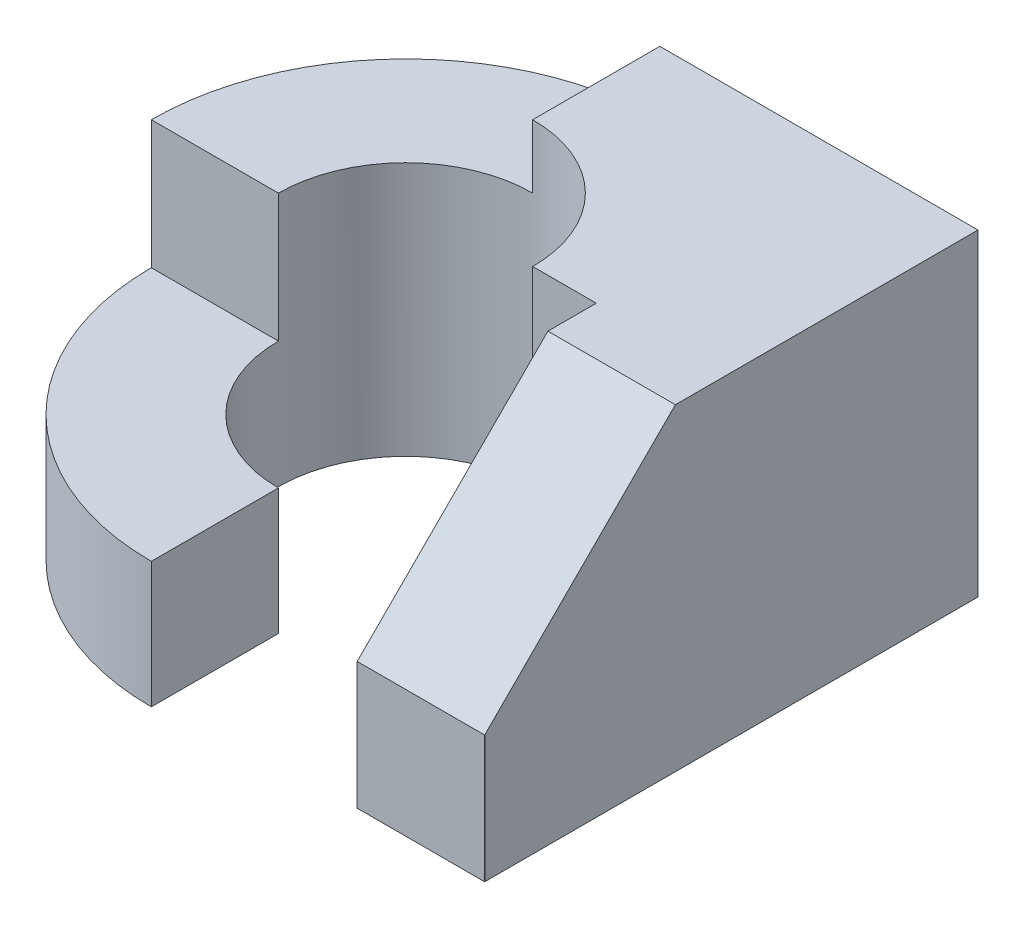
ISO-10303-21;
HEADER;
FILE_DESCRIPTION(('STEP AP214'),'2;1');
FILE_NAME('part.step','',(''),(''),'','','');
FILE_SCHEMA(('AUTOMOTIVE_DESIGN { 1 0 10303 214 1 1 1 1 }'));
ENDSEC;
DATA;
#1=APPLICATION_CONTEXT('core data for automotive mechanical design processes');
#2=APPLICATION_PROTOCOL_DEFINITION('international standard','automotive_design',2000,#1);
#3=PRODUCT_CONTEXT('',#1,'mechanical');
#4=PRODUCT('Part','Part','',(#3));
#5=PRODUCT_RELATED_PRODUCT_CATEGORY('part','',(#4));
#6=PRODUCT_DEFINITION_FORMATION('','',#4);
#7=PRODUCT_DEFINITION_CONTEXT('part definition',#1,'design');
#8=PRODUCT_DEFINITION('design','',#6,#7);
#9=PRODUCT_DEFINITION_SHAPE('','',#8);
#10=(LENGTH_UNIT() NAMED_UNIT(*) SI_UNIT(.MILLI.,.METRE.));
#11=(NAMED_UNIT(*) PLANE_ANGLE_UNIT() SI_UNIT($,.RADIAN.));
#12=(NAMED_UNIT(*) SI_UNIT($,.STERADIAN.) SOLID_ANGLE_UNIT());
#13=UNCERTAINTY_MEASURE_WITH_UNIT(LENGTH_MEASURE(1.E-05),#10,'distance_accuracy_value','');
#14=(GEOMETRIC_REPRESENTATION_CONTEXT(3) GLOBAL_UNCERTAINTY_ASSIGNED_CONTEXT((#13)) GLOBAL_UNIT_ASSIGNED_CONTEXT((#10,
#11,#12)) REPRESENTATION_CONTEXT('',''));
#15=CARTESIAN_POINT('',(0.,0.,0.));
#16=DIRECTION('',(0.,0.,1.));
#17=DIRECTION('',(1.,0.,0.));
#18=AXIS2_PLACEMENT_3D('',#15,#16,#17);
#19=CARTESIAN_POINT('',(0.,5.,0.));
#20=DIRECTION('',(0.,-1.,0.));
#21=DIRECTION('',(0.,0.,-1.));
#22=AXIS2_PLACEMENT_3D('',#19,#20,#21);
#23=CYLINDRICAL_SURFACE('',#22,4.);
#24=DIRECTION('',(0.,-1.,0.));
#25=VECTOR('',#24,1.);
#26=CARTESIAN_POINT('',(-4.,5.,0.));
#27=LINE('',#26,#25);
#28=CARTESIAN_POINT('',(-4.,1.98353352652632,0.));
#29=VERTEX_POINT('',#28);
#30=CARTESIAN_POINT('',(-4.,4.,0.));
#31=VERTEX_POINT('',#30);
#32=EDGE_CURVE('E253',#29,#31,#27,.F.);
#33=ORIENTED_EDGE('',*,*,#32,.T.);
#34=CARTESIAN_POINT('',(0.,4.,0.));
#35=DIRECTION('',(0.,-1.,0.));
#36=DIRECTION('',(0.,0.,-1.));
#37=AXIS2_PLACEMENT_3D('',#34,#35,#36);
#38=CIRCLE('',#37,4.);
#39=CARTESIAN_POINT('',(0.,4.,-4.));
#40=VERTEX_POINT('',#39);
#41=EDGE_CURVE('E256',#31,#40,#38,.T.);
#42=ORIENTED_EDGE('',*,*,#41,.T.);
#43=DIRECTION('',(0.,-1.,0.));
#44=VECTOR('',#43,1.);
#45=CARTESIAN_POINT('',(0.,5.,-4.));
#46=LINE('',#45,#44);
#47=CARTESIAN_POINT('',(0.,0.,-4.));
#48=VERTEX_POINT('',#47);
#49=EDGE_CURVE('E243',#40,#48,#46,.T.);
#50=ORIENTED_EDGE('',*,*,#49,.T.);
#51=CARTESIAN_POINT('',(0.,0.,0.));
#52=DIRECTION('',(0.,1.,0.));
#53=DIRECTION('',(0.,0.,1.));
#54=AXIS2_PLACEMENT_3D('',#51,#52,#53);
#55=CIRCLE('',#54,4.);
#56=CARTESIAN_POINT('',(0.,0.,4.));
#57=VERTEX_POINT('',#56);
#58=EDGE_CURVE('E212',#48,#57,#55,.T.);
#59=ORIENTED_EDGE('',*,*,#58,.T.);
#60=DIRECTION('',(0.,-1.,0.));
#61=VECTOR('',#60,1.);
#62=CARTESIAN_POINT('',(0.,5.,4.));
#63=LINE('',#62,#61);
#64=CARTESIAN_POINT('',(0.,1.98353352652632,4.));
#65=VERTEX_POINT('',#64);
#66=EDGE_CURVE('E211',#65,#57,#63,.T.);
#67=ORIENTED_EDGE('',*,*,#66,.F.);
#68=CARTESIAN_POINT('',(0.,1.98353352652632,0.));
#69=DIRECTION('',(0.,-1.,0.));
#70=DIRECTION('',(0.,0.,-1.));
#71=AXIS2_PLACEMENT_3D('',#68,#69,#70);
#72=CIRCLE('',#71,4.);
#73=EDGE_CURVE('E209',#65,#29,#72,.T.);
#74=ORIENTED_EDGE('',*,*,#73,.T.);
#75=EDGE_LOOP('',(#33,#42,#50,#59,#67,#74));
#76=FACE_BOUND('',#75,.T.);
#77=ADVANCED_FACE('F35',(#76),#23,.T.);
#78=CARTESIAN_POINT('',(0.,5.,0.));
#79=DIRECTION('',(1.,0.,0.));
#80=DIRECTION('',(0.,0.,-1.));
#81=AXIS2_PLACEMENT_3D('',#78,#79,#80);
#82=PLANE('',#81);
#83=DIRECTION('',(0.,0.,-1.));
#84=VECTOR('',#83,1.);
#85=CARTESIAN_POINT('',(0.,1.98353352652632,0.));
#86=LINE('',#85,#84);
#87=CARTESIAN_POINT('',(0.,1.98353352652632,2.));
#88=VERTEX_POINT('',#87);
#89=EDGE_CURVE('E205',#65,#88,#86,.T.);
#90=ORIENTED_EDGE('',*,*,#89,.F.);
#91=ORIENTED_EDGE('',*,*,#66,.T.);
#92=DIRECTION('',(0.,0.,1.));
#93=VECTOR('',#92,1.);
#94=CARTESIAN_POINT('',(0.,0.,0.));
#95=LINE('',#94,#93);
#96=CARTESIAN_POINT('',(0.,0.,2.));
#97=VERTEX_POINT('',#96);
#98=EDGE_CURVE('E228',#97,#57,#95,.T.);
#99=ORIENTED_EDGE('',*,*,#98,.F.);
#100=DIRECTION('',(0.,-1.,0.));
#101=VECTOR('',#100,1.);
#102=CARTESIAN_POINT('',(0.,5.,2.));
#103=LINE('',#102,#101);
#104=EDGE_CURVE('E159',#88,#97,#103,.T.);
#105=ORIENTED_EDGE('',*,*,#104,.F.);
#106=EDGE_LOOP('',(#90,#91,#99,#105));
#107=FACE_BOUND('',#106,.T.);
#108=ADVANCED_FACE('F268',(#107),#82,.T.);
#109=CARTESIAN_POINT('',(0.,5.,0.));
#110=DIRECTION('',(0.,1.,0.));
#111=DIRECTION('',(0.,0.,1.));
#112=AXIS2_PLACEMENT_3D('',#109,#110,#111);
#113=PLANE('',#112);
#114=DIRECTION('',(0.,0.,1.));
#115=VECTOR('',#114,1.);
#116=CARTESIAN_POINT('',(3.,5.,0.));
#117=LINE('',#116,#115);
#118=CARTESIAN_POINT('',(3.,5.,0.));
#119=VERTEX_POINT('',#118);
#120=CARTESIAN_POINT('',(3.,5.,0.760972676788419));
#121=VERTEX_POINT('',#120);
#122=EDGE_CURVE('E191',#119,#121,#117,.T.);
#123=ORIENTED_EDGE('',*,*,#122,.T.);
#124=DIRECTION('',(1.,0.,0.));
#125=VECTOR('',#124,1.);
#126=CARTESIAN_POINT('',(4.99865006533927,5.,0.760972676788419));
#127=LINE('',#126,#125);
#128=CARTESIAN_POINT('',(5.00521632146891,5.,0.760972676788419));
#129=VERTEX_POINT('',#128);
#130=EDGE_CURVE('E165',#121,#129,#127,.T.);
#131=ORIENTED_EDGE('',*,*,#130,.T.);
#132=DIRECTION('',(0.,0.,-1.));
#133=VECTOR('',#132,1.);
#134=CARTESIAN_POINT('',(5.00521632146891,5.,0.));
#135=LINE('',#134,#133);
#136=CARTESIAN_POINT('',(5.00521632146891,5.,-4.));
#137=VERTEX_POINT('',#136);
#138=EDGE_CURVE('E161',#129,#137,#135,.T.);
#139=ORIENTED_EDGE('',*,*,#138,.T.);
#140=DIRECTION('',(-1.,0.,0.));
#141=VECTOR('',#140,1.);
#142=CARTESIAN_POINT('',(0.,5.,-4.));
#143=LINE('',#142,#141);
#144=CARTESIAN_POINT('',(0.,5.,-4.));
#145=VERTEX_POINT('',#144);
#146=EDGE_CURVE('E150',#137,#145,#143,.T.);
#147=ORIENTED_EDGE('',*,*,#146,.T.);
#148=DIRECTION('',(0.,0.,1.));
#149=VECTOR('',#148,1.);
#150=CARTESIAN_POINT('',(0.,5.,-4.));
#151=LINE('',#150,#149);
#152=CARTESIAN_POINT('',(0.,5.,-2.));
#153=VERTEX_POINT('',#152);
#154=EDGE_CURVE('E136',#145,#153,#151,.T.);
#155=ORIENTED_EDGE('',*,*,#154,.T.);
#156=CARTESIAN_POINT('',(0.,5.,0.));
#157=DIRECTION('',(0.,1.,0.));
#158=DIRECTION('',(0.,0.,1.));
#159=AXIS2_PLACEMENT_3D('',#156,#157,#158);
#160=CIRCLE('',#159,2.);
#161=CARTESIAN_POINT('',(2.,5.,0.));
#162=VERTEX_POINT('',#161);
#163=EDGE_CURVE('E143',#162,#153,#160,.T.);
#164=ORIENTED_EDGE('',*,*,#163,.F.);
#165=DIRECTION('',(1.,0.,0.));
#166=VECTOR('',#165,1.);
#167=CARTESIAN_POINT('',(0.,5.,0.));
#168=LINE('',#167,#166);
#169=EDGE_CURVE('E152',#162,#119,#168,.T.);
#170=ORIENTED_EDGE('',*,*,#169,.T.);
#171=EDGE_LOOP('',(#123,#131,#139,#147,#155,#164,#170));
#172=FACE_BOUND('',#171,.T.);
#173=ADVANCED_FACE('F148',(#172),#113,.T.);
#174=CARTESIAN_POINT('',(0.,5.,0.));
#175=DIRECTION('',(0.,-1.,0.));
#176=DIRECTION('',(0.,0.,-1.));
#177=AXIS2_PLACEMENT_3D('',#174,#175,#176);
#178=CYLINDRICAL_SURFACE('',#177,2.);
#179=CARTESIAN_POINT('',(0.,1.98353352652632,0.));
#180=DIRECTION('',(0.,-1.,0.));
#181=DIRECTION('',(0.,0.,-1.));
#182=AXIS2_PLACEMENT_3D('',#179,#180,#181);
#183=CIRCLE('',#182,2.);
#184=CARTESIAN_POINT('',(-2.,1.98353352652632,0.));
#185=VERTEX_POINT('',#184);
#186=EDGE_CURVE('E206',#88,#185,#183,.T.);
#187=ORIENTED_EDGE('',*,*,#186,.F.);
#188=ORIENTED_EDGE('',*,*,#104,.T.);
#189=CARTESIAN_POINT('',(0.,0.,0.));
#190=DIRECTION('',(0.,1.,0.));
#191=DIRECTION('',(0.,0.,1.));
#192=AXIS2_PLACEMENT_3D('',#189,#190,#191);
#193=CIRCLE('',#192,2.);
#194=CARTESIAN_POINT('',(2.,0.,0.));
#195=VERTEX_POINT('',#194);
#196=EDGE_CURVE('E225',#195,#97,#193,.T.);
#197=ORIENTED_EDGE('',*,*,#196,.F.);
#198=DIRECTION('',(0.,-1.,0.));
#199=VECTOR('',#198,1.);
#200=CARTESIAN_POINT('',(2.,5.,0.));
#201=LINE('',#200,#199);
#202=EDGE_CURVE('E157',#162,#195,#201,.T.);
#203=ORIENTED_EDGE('',*,*,#202,.F.);
#204=ORIENTED_EDGE('',*,*,#163,.T.);
#205=DIRECTION('',(0.,-1.,0.));
#206=VECTOR('',#205,1.);
#207=CARTESIAN_POINT('',(0.,5.,-2.));
#208=LINE('',#207,#206);
#209=CARTESIAN_POINT('',(0.,4.,-2.));
#210=VERTEX_POINT('',#209);
#211=EDGE_CURVE('E132',#153,#210,#208,.T.);
#212=ORIENTED_EDGE('',*,*,#211,.T.);
#213=CARTESIAN_POINT('',(0.,4.,0.));
#214=DIRECTION('',(0.,-1.,0.));
#215=DIRECTION('',(0.,0.,-1.));
#216=AXIS2_PLACEMENT_3D('',#213,#214,#215);
#217=CIRCLE('',#216,2.);
#218=CARTESIAN_POINT('',(-2.,4.,0.));
#219=VERTEX_POINT('',#218);
#220=EDGE_CURVE('E200',#219,#210,#217,.T.);
#221=ORIENTED_EDGE('',*,*,#220,.F.);
#222=DIRECTION('',(0.,-1.,0.));
#223=VECTOR('',#222,1.);
#224=CARTESIAN_POINT('',(-2.,5.,0.));
#225=LINE('',#224,#223);
#226=EDGE_CURVE('E203',#185,#219,#225,.F.);
#227=ORIENTED_EDGE('',*,*,#226,.F.);
#228=EDGE_LOOP('',(#187,#188,#197,#203,#204,#212,#221,#227));
#229=FACE_BOUND('',#228,.T.);
#230=ADVANCED_FACE('F155',(#229),#178,.F.);
#231=CARTESIAN_POINT('',(0.,5.,0.));
#232=DIRECTION('',(0.,0.,-1.));
#233=DIRECTION('',(-1.,0.,0.));
#234=AXIS2_PLACEMENT_3D('',#231,#232,#233);
#235=PLANE('',#234);
#236=DIRECTION('',(1.,0.,0.));
#237=VECTOR('',#236,1.);
#238=CARTESIAN_POINT('',(0.,0.,0.));
#239=LINE('',#238,#237);
#240=CARTESIAN_POINT('',(3.,0.,0.));
#241=VERTEX_POINT('',#240);
#242=EDGE_CURVE('E142',#195,#241,#239,.T.);
#243=ORIENTED_EDGE('',*,*,#242,.T.);
#244=DIRECTION('',(0.,-1.,0.));
#245=VECTOR('',#244,1.);
#246=CARTESIAN_POINT('',(3.,5.,0.));
#247=LINE('',#246,#245);
#248=EDGE_CURVE('E233',#119,#241,#247,.T.);
#249=ORIENTED_EDGE('',*,*,#248,.F.);
#250=ORIENTED_EDGE('',*,*,#169,.F.);
#251=ORIENTED_EDGE('',*,*,#202,.T.);
#252=EDGE_LOOP('',(#243,#249,#250,#251));
#253=FACE_BOUND('',#252,.T.);
#254=ADVANCED_FACE('F294',(#253),#235,.F.);
#255=CARTESIAN_POINT('',(3.,5.,0.));
#256=DIRECTION('',(1.,0.,0.));
#257=DIRECTION('',(0.,0.,-1.));
#258=AXIS2_PLACEMENT_3D('',#255,#256,#257);
#259=PLANE('',#258);
#260=DIRECTION('',(0.,-1.,0.));
#261=VECTOR('',#260,1.);
#262=CARTESIAN_POINT('',(3.,5.,3.76097267678843));
#263=LINE('',#262,#261);
#264=CARTESIAN_POINT('',(3.,1.99999999999999,3.76097267678843));
#265=VERTEX_POINT('',#264);
#266=CARTESIAN_POINT('',(3.,0.,3.76097267678843));
#267=VERTEX_POINT('',#266);
#268=EDGE_CURVE('E193',#265,#267,#263,.T.);
#269=ORIENTED_EDGE('',*,*,#268,.F.);
#270=DIRECTION('',(0.,0.707106781186548,-0.707106781186548));
#271=VECTOR('',#270,1.);
#272=CARTESIAN_POINT('',(3.,5.,0.760972676788418));
#273=LINE('',#272,#271);
#274=EDGE_CURVE('E11',#265,#121,#273,.T.);
#275=ORIENTED_EDGE('',*,*,#274,.T.);
#276=ORIENTED_EDGE('',*,*,#122,.F.);
#277=ORIENTED_EDGE('',*,*,#248,.T.);
#278=DIRECTION('',(0.,0.,1.));
#279=VECTOR('',#278,1.);
#280=CARTESIAN_POINT('',(3.,0.,0.));
#281=LINE('',#280,#279);
#282=EDGE_CURVE('E231',#241,#267,#281,.T.);
#283=ORIENTED_EDGE('',*,*,#282,.T.);
#284=EDGE_LOOP('',(#269,#275,#276,#277,#283));
#285=FACE_BOUND('',#284,.T.);
#286=ADVANCED_FACE('F189',(#285),#259,.F.);
#287=CARTESIAN_POINT('',(0.,5.,3.76097267678843));
#288=DIRECTION('',(0.,0.,-1.));
#289=DIRECTION('',(-1.,0.,0.));
#290=AXIS2_PLACEMENT_3D('',#287,#288,#289);
#291=PLANE('',#290);
#292=DIRECTION('',(0.,-1.,0.));
#293=VECTOR('',#292,1.);
#294=CARTESIAN_POINT('',(4.99865006533927,5.,3.76097267678843));
#295=LINE('',#294,#293);
#296=CARTESIAN_POINT('',(4.99865006533927,1.99999999999999,3.76097267678843));
#297=VERTEX_POINT('',#296);
#298=CARTESIAN_POINT('',(4.99865006533927,0.,3.76097267678843));
#299=VERTEX_POINT('',#298);
#300=EDGE_CURVE('E238',#297,#299,#295,.T.);
#301=ORIENTED_EDGE('',*,*,#300,.F.);
#302=DIRECTION('',(-1.,0.,0.));
#303=VECTOR('',#302,1.);
#304=CARTESIAN_POINT('',(3.,1.99999999999999,3.76097267678843));
#305=LINE('',#304,#303);
#306=EDGE_CURVE('E43',#297,#265,#305,.T.);
#307=ORIENTED_EDGE('',*,*,#306,.T.);
#308=ORIENTED_EDGE('',*,*,#268,.T.);
#309=DIRECTION('',(1.,0.,0.));
#310=VECTOR('',#309,1.);
#311=CARTESIAN_POINT('',(0.,0.,3.76097267678843));
#312=LINE('',#311,#310);
#313=EDGE_CURVE('E234',#267,#299,#312,.T.);
#314=ORIENTED_EDGE('',*,*,#313,.T.);
#315=EDGE_LOOP('',(#301,#307,#308,#314));
#316=FACE_BOUND('',#315,.T.);
#317=ADVANCED_FACE('F319',(#316),#291,.F.);
#318=CARTESIAN_POINT('',(2.68170270810586,5.,5.00292014414876));
#319=DIRECTION('',(-0.472435886548881,0.,-0.881365039640655));
#320=DIRECTION('',(-0.881365039640655,0.,0.472435886548881));
#321=AXIS2_PLACEMENT_3D('',#318,#319,#320);
#322=PLANE('',#321);
#323=DIRECTION('',(0.,-1.,0.));
#324=VECTOR('',#323,1.);
#325=CARTESIAN_POINT('',(5.00521632146891,5.,3.75745298302206));
#326=LINE('',#325,#324);
#327=CARTESIAN_POINT('',(5.00521632146891,2.00351969376635,3.75745298302206));
#328=VERTEX_POINT('',#327);
#329=CARTESIAN_POINT('',(5.00521632146891,0.,3.75745298302206));
#330=VERTEX_POINT('',#329);
#331=EDGE_CURVE('E174',#328,#330,#326,.T.);
#332=ORIENTED_EDGE('',*,*,#331,.F.);
#333=DIRECTION('',(-0.796907387330017,-0.427164263497572,0.427164263497572));
#334=VECTOR('',#333,1.);
#335=CARTESIAN_POINT('',(3.86666257991505,1.39322359387356,4.36774908291486));
#336=LINE('',#335,#334);
#337=EDGE_CURVE('E57',#328,#297,#336,.T.);
#338=ORIENTED_EDGE('',*,*,#337,.T.);
#339=ORIENTED_EDGE('',*,*,#300,.T.);
#340=DIRECTION('',(0.881365039640655,0.,-0.472435886548881));
#341=VECTOR('',#340,1.);
#342=CARTESIAN_POINT('',(2.68170270810586,0.,5.00292014414876));
#343=LINE('',#342,#341);
#344=EDGE_CURVE('E181',#299,#330,#343,.T.);
#345=ORIENTED_EDGE('',*,*,#344,.T.);
#346=EDGE_LOOP('',(#332,#338,#339,#345));
#347=FACE_BOUND('',#346,.T.);
#348=ADVANCED_FACE('F179',(#347),#322,.F.);
#349=CARTESIAN_POINT('',(5.00521632146891,5.,0.));
#350=DIRECTION('',(-1.,0.,0.));
#351=DIRECTION('',(0.,0.,1.));
#352=AXIS2_PLACEMENT_3D('',#349,#350,#351);
#353=PLANE('',#352);
#354=ORIENTED_EDGE('',*,*,#138,.F.);
#355=DIRECTION('',(0.,-0.707106781186548,0.707106781186548));
#356=VECTOR('',#355,1.);
#357=CARTESIAN_POINT('',(5.00521632146891,5.,0.760972676788418));
#358=LINE('',#357,#356);
#359=EDGE_CURVE('E168',#129,#328,#358,.T.);
#360=ORIENTED_EDGE('',*,*,#359,.T.);
#361=ORIENTED_EDGE('',*,*,#331,.T.);
#362=DIRECTION('',(0.,0.,-1.));
#363=VECTOR('',#362,1.);
#364=CARTESIAN_POINT('',(5.00521632146891,0.,0.));
#365=LINE('',#364,#363);
#366=CARTESIAN_POINT('',(5.00521632146891,0.,-4.));
#367=VERTEX_POINT('',#366);
#368=EDGE_CURVE('E184',#330,#367,#365,.T.);
#369=ORIENTED_EDGE('',*,*,#368,.T.);
#370=DIRECTION('',(0.,-1.,0.));
#371=VECTOR('',#370,1.);
#372=CARTESIAN_POINT('',(5.00521632146891,5.,-4.));
#373=LINE('',#372,#371);
#374=EDGE_CURVE('E229',#137,#367,#373,.T.);
#375=ORIENTED_EDGE('',*,*,#374,.F.);
#376=EDGE_LOOP('',(#354,#360,#361,#369,#375));
#377=FACE_BOUND('',#376,.T.);
#378=ADVANCED_FACE('F173',(#377),#353,.F.);
#379=CARTESIAN_POINT('',(0.,5.,-4.));
#380=DIRECTION('',(0.,0.,1.));
#381=DIRECTION('',(1.,0.,0.));
#382=AXIS2_PLACEMENT_3D('',#379,#380,#381);
#383=PLANE('',#382);
#384=DIRECTION('',(-1.,0.,0.));
#385=VECTOR('',#384,1.);
#386=CARTESIAN_POINT('',(0.,0.,-4.));
#387=LINE('',#386,#385);
#388=EDGE_CURVE('E183',#367,#48,#387,.T.);
#389=ORIENTED_EDGE('',*,*,#388,.T.);
#390=ORIENTED_EDGE('',*,*,#49,.F.);
#391=EDGE_CURVE('E208',#145,#40,#46,.T.);
#392=ORIENTED_EDGE('',*,*,#391,.F.);
#393=ORIENTED_EDGE('',*,*,#146,.F.);
#394=ORIENTED_EDGE('',*,*,#374,.T.);
#395=EDGE_LOOP('',(#389,#390,#392,#393,#394));
#396=FACE_BOUND('',#395,.T.);
#397=ADVANCED_FACE('F263',(#396),#383,.F.);
#398=CARTESIAN_POINT('',(0.,0.,0.));
#399=DIRECTION('',(0.,1.,0.));
#400=DIRECTION('',(0.,0.,1.));
#401=AXIS2_PLACEMENT_3D('',#398,#399,#400);
#402=PLANE('',#401);
#403=ORIENTED_EDGE('',*,*,#196,.T.);
#404=ORIENTED_EDGE('',*,*,#98,.T.);
#405=ORIENTED_EDGE('',*,*,#58,.F.);
#406=ORIENTED_EDGE('',*,*,#388,.F.);
#407=ORIENTED_EDGE('',*,*,#368,.F.);
#408=ORIENTED_EDGE('',*,*,#344,.F.);
#409=ORIENTED_EDGE('',*,*,#313,.F.);
#410=ORIENTED_EDGE('',*,*,#282,.F.);
#411=ORIENTED_EDGE('',*,*,#242,.F.);
#412=EDGE_LOOP('',(#403,#404,#405,#406,#407,#408,#409,#410,#411));
#413=FACE_BOUND('',#412,.T.);
#414=ADVANCED_FACE('F265',(#413),#402,.F.);
#415=CARTESIAN_POINT('',(0.,0.,0.));
#416=DIRECTION('',(-1.,0.,0.));
#417=DIRECTION('',(0.,0.,1.));
#418=AXIS2_PLACEMENT_3D('',#415,#416,#417);
#419=PLANE('',#418);
#420=ORIENTED_EDGE('',*,*,#154,.F.);
#421=ORIENTED_EDGE('',*,*,#391,.T.);
#422=DIRECTION('',(0.,0.,-1.));
#423=VECTOR('',#422,1.);
#424=CARTESIAN_POINT('',(0.,4.,-4.));
#425=LINE('',#424,#423);
#426=EDGE_CURVE('E138',#210,#40,#425,.T.);
#427=ORIENTED_EDGE('',*,*,#426,.F.);
#428=ORIENTED_EDGE('',*,*,#211,.F.);
#429=EDGE_LOOP('',(#420,#421,#427,#428));
#430=FACE_BOUND('',#429,.T.);
#431=ADVANCED_FACE('F134',(#430),#419,.T.);
#432=CARTESIAN_POINT('',(-5.,1.98353352652632,0.));
#433=DIRECTION('',(0.,-1.,0.));
#434=DIRECTION('',(0.,0.,-1.));
#435=AXIS2_PLACEMENT_3D('',#432,#433,#434);
#436=PLANE('',#435);
#437=ORIENTED_EDGE('',*,*,#186,.T.);
#438=DIRECTION('',(1.,0.,0.));
#439=VECTOR('',#438,1.);
#440=CARTESIAN_POINT('',(-5.,1.98353352652632,0.));
#441=LINE('',#440,#439);
#442=EDGE_CURVE('E202',#29,#185,#441,.T.);
#443=ORIENTED_EDGE('',*,*,#442,.F.);
#444=ORIENTED_EDGE('',*,*,#73,.F.);
#445=ORIENTED_EDGE('',*,*,#89,.T.);
#446=EDGE_LOOP('',(#437,#443,#444,#445));
#447=FACE_BOUND('',#446,.T.);
#448=ADVANCED_FACE('F272',(#447),#436,.F.);
#449=CARTESIAN_POINT('',(-5.,1.98353352652632,0.));
#450=DIRECTION('',(0.,0.,-1.));
#451=DIRECTION('',(0.,1.,0.));
#452=AXIS2_PLACEMENT_3D('',#449,#450,#451);
#453=PLANE('',#452);
#454=ORIENTED_EDGE('',*,*,#226,.T.);
#455=DIRECTION('',(1.,0.,0.));
#456=VECTOR('',#455,1.);
#457=CARTESIAN_POINT('',(-5.,4.,0.));
#458=LINE('',#457,#456);
#459=EDGE_CURVE('E169',#31,#219,#458,.T.);
#460=ORIENTED_EDGE('',*,*,#459,.F.);
#461=ORIENTED_EDGE('',*,*,#32,.F.);
#462=ORIENTED_EDGE('',*,*,#442,.T.);
#463=EDGE_LOOP('',(#454,#460,#461,#462));
#464=FACE_BOUND('',#463,.T.);
#465=ADVANCED_FACE('F274',(#464),#453,.F.);
#466=CARTESIAN_POINT('',(-5.,4.,-4.));
#467=DIRECTION('',(0.,-1.,0.));
#468=DIRECTION('',(0.,0.,-1.));
#469=AXIS2_PLACEMENT_3D('',#466,#467,#468);
#470=PLANE('',#469);
#471=ORIENTED_EDGE('',*,*,#220,.T.);
#472=ORIENTED_EDGE('',*,*,#426,.T.);
#473=ORIENTED_EDGE('',*,*,#41,.F.);
#474=ORIENTED_EDGE('',*,*,#459,.T.);
#475=EDGE_LOOP('',(#471,#472,#473,#474));
#476=FACE_BOUND('',#475,.T.);
#477=ADVANCED_FACE('F277',(#476),#470,.F.);
#478=CARTESIAN_POINT('',(0.,5.,0.760972676788418));
#479=DIRECTION('',(0.,0.707106781186547,0.707106781186547));
#480=DIRECTION('',(-1.,0.,0.));
#481=AXIS2_PLACEMENT_3D('',#478,#479,#480);
#482=PLANE('',#481);
#483=ORIENTED_EDGE('',*,*,#274,.F.);
#484=ORIENTED_EDGE('',*,*,#306,.F.);
#485=ORIENTED_EDGE('',*,*,#337,.F.);
#486=ORIENTED_EDGE('',*,*,#359,.F.);
#487=ORIENTED_EDGE('',*,*,#130,.F.);
#488=EDGE_LOOP('',(#483,#484,#485,#486,#487));
#489=FACE_BOUND('',#488,.T.);
#490=ADVANCED_FACE('F37',(#489),#482,.T.);
#491=CLOSED_SHELL('',(#77,#108,#173,#230,#254,#286,#317,#348,#378,#397,#414,#431,#448,#465,#477,#490));
#492=MANIFOLD_SOLID_BREP('B2',#491);
#493=ADVANCED_BREP_SHAPE_REPRESENTATION('',(#18,#492),#14);
#494=SHAPE_DEFINITION_REPRESENTATION(#9,#493);
ENDSEC;
END-ISO-10303-21;
